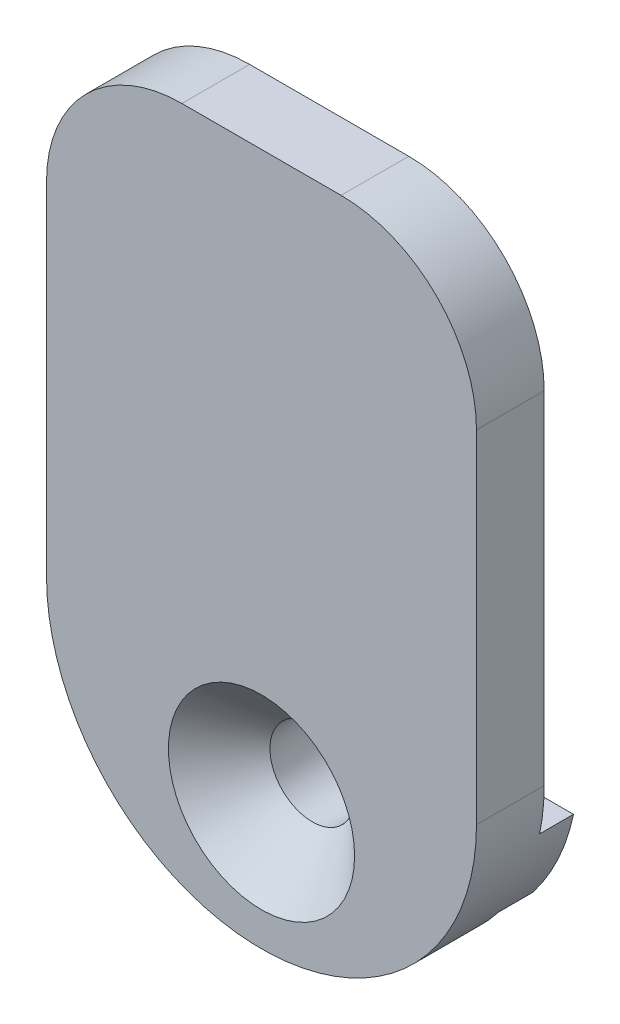
ISO-10303-21;
HEADER;
FILE_DESCRIPTION(('STEP AP214'),'2;1');
FILE_NAME('part.step','',(''),(''),'','','');
FILE_SCHEMA(('AUTOMOTIVE_DESIGN { 1 0 10303 214 1 1 1 1 }'));
ENDSEC;
DATA;
#1=APPLICATION_CONTEXT('core data for automotive mechanical design processes');
#2=APPLICATION_PROTOCOL_DEFINITION('international standard','automotive_design',2000,#1);
#3=PRODUCT_CONTEXT('',#1,'mechanical');
#4=PRODUCT('Part','Part','',(#3));
#5=PRODUCT_RELATED_PRODUCT_CATEGORY('part','',(#4));
#6=PRODUCT_DEFINITION_FORMATION('','',#4);
#7=PRODUCT_DEFINITION_CONTEXT('part definition',#1,'design');
#8=PRODUCT_DEFINITION('design','',#6,#7);
#9=PRODUCT_DEFINITION_SHAPE('','',#8);
#10=(LENGTH_UNIT() NAMED_UNIT(*) SI_UNIT(.MILLI.,.METRE.));
#11=(NAMED_UNIT(*) PLANE_ANGLE_UNIT() SI_UNIT($,.RADIAN.));
#12=(NAMED_UNIT(*) SI_UNIT($,.STERADIAN.) SOLID_ANGLE_UNIT());
#13=UNCERTAINTY_MEASURE_WITH_UNIT(LENGTH_MEASURE(1.E-05),#10,'distance_accuracy_value','');
#14=(GEOMETRIC_REPRESENTATION_CONTEXT(3) GLOBAL_UNCERTAINTY_ASSIGNED_CONTEXT((#13)) GLOBAL_UNIT_ASSIGNED_CONTEXT((#10,
#11,#12)) REPRESENTATION_CONTEXT('',''));
#15=CARTESIAN_POINT('',(0.,0.,0.));
#16=DIRECTION('',(0.,0.,1.));
#17=DIRECTION('',(1.,0.,0.));
#18=AXIS2_PLACEMENT_3D('',#15,#16,#17);
#19=CARTESIAN_POINT('',(0.,5.2,-4.));
#20=DIRECTION('',(0.,0.,-1.));
#21=DIRECTION('',(-1.,0.,0.));
#22=AXIS2_PLACEMENT_3D('',#19,#20,#21);
#23=PLANE('',#22);
#24=CARTESIAN_POINT('',(0.,5.2,-4.));
#25=DIRECTION('',(0.,0.,1.));
#26=DIRECTION('',(1.,0.,0.));
#27=AXIS2_PLACEMENT_3D('',#24,#25,#26);
#28=CIRCLE('',#27,12.7);
#29=CARTESIAN_POINT('',(-10.0224747442934,-2.59999999999999,-4.));
#30=VERTEX_POINT('',#29);
#31=CARTESIAN_POINT('',(10.0224747442934,-2.6,-4.));
#32=VERTEX_POINT('',#31);
#33=EDGE_CURVE('E141',#30,#32,#28,.T.);
#34=ORIENTED_EDGE('',*,*,#33,.F.);
#35=DIRECTION('',(-1.,0.,0.));
#36=VECTOR('',#35,1.);
#37=CARTESIAN_POINT('',(-12.7,-2.6,-4.));
#38=LINE('',#37,#36);
#39=EDGE_CURVE('E135',#30,#32,#38,.F.);
#40=ORIENTED_EDGE('',*,*,#39,.T.);
#41=EDGE_LOOP('',(#34,#40));
#42=FACE_BOUND('',#41,.T.);
#43=ADVANCED_FACE('F17',(#42),#23,.T.);
#44=CARTESIAN_POINT('',(-12.7,-2.6,-6.));
#45=DIRECTION('',(0.,1.,0.));
#46=DIRECTION('',(-1.,0.,0.));
#47=AXIS2_PLACEMENT_3D('',#44,#45,#46);
#48=PLANE('',#47);
#49=DIRECTION('',(-1.,0.,0.));
#50=VECTOR('',#49,1.);
#51=CARTESIAN_POINT('',(0.,-2.6,-6.));
#52=LINE('',#51,#50);
#53=CARTESIAN_POINT('',(10.0224747442934,-2.6,-6.));
#54=VERTEX_POINT('',#53);
#55=CARTESIAN_POINT('',(-10.0224747442934,-2.6,-6.));
#56=VERTEX_POINT('',#55);
#57=EDGE_CURVE('E133',#54,#56,#52,.T.);
#58=ORIENTED_EDGE('',*,*,#57,.F.);
#59=DIRECTION('',(0.,0.,1.));
#60=VECTOR('',#59,1.);
#61=CARTESIAN_POINT('',(10.0224747442934,-2.6,-4.));
#62=LINE('',#61,#60);
#63=EDGE_CURVE('E147',#32,#54,#62,.F.);
#64=ORIENTED_EDGE('',*,*,#63,.F.);
#65=ORIENTED_EDGE('',*,*,#39,.F.);
#66=DIRECTION('',(0.,0.,1.));
#67=VECTOR('',#66,1.);
#68=CARTESIAN_POINT('',(-10.0224747442934,-2.59999999999999,-4.));
#69=LINE('',#68,#67);
#70=EDGE_CURVE('E139',#56,#30,#69,.T.);
#71=ORIENTED_EDGE('',*,*,#70,.F.);
#72=EDGE_LOOP('',(#58,#64,#65,#71));
#73=FACE_BOUND('',#72,.T.);
#74=ADVANCED_FACE('F177',(#73),#48,.F.);
#75=CARTESIAN_POINT('',(-12.7,2.6,-6.));
#76=DIRECTION('',(0.,-1.,0.));
#77=DIRECTION('',(0.,0.,-1.));
#78=AXIS2_PLACEMENT_3D('',#75,#76,#77);
#79=PLANE('',#78);
#80=DIRECTION('',(-1.,0.,0.));
#81=VECTOR('',#80,1.);
#82=CARTESIAN_POINT('',(0.,2.6,-6.));
#83=LINE('',#82,#81);
#84=CARTESIAN_POINT('',(-12.4310096130604,2.60000000000001,-6.));
#85=VERTEX_POINT('',#84);
#86=CARTESIAN_POINT('',(12.4310096130604,2.6,-6.));
#87=VERTEX_POINT('',#86);
#88=EDGE_CURVE('E130',#85,#87,#83,.F.);
#89=ORIENTED_EDGE('',*,*,#88,.F.);
#90=DIRECTION('',(0.,0.,1.));
#91=VECTOR('',#90,1.);
#92=CARTESIAN_POINT('',(-12.4310096130604,2.60000000000001,-4.));
#93=LINE('',#92,#91);
#94=CARTESIAN_POINT('',(-12.4310096130604,2.60000000000001,-4.));
#95=VERTEX_POINT('',#94);
#96=EDGE_CURVE('E136',#95,#85,#93,.F.);
#97=ORIENTED_EDGE('',*,*,#96,.F.);
#98=DIRECTION('',(-1.,0.,0.));
#99=VECTOR('',#98,1.);
#100=CARTESIAN_POINT('',(0.,2.6,-4.));
#101=LINE('',#100,#99);
#102=CARTESIAN_POINT('',(12.4310096130604,2.6,-4.));
#103=VERTEX_POINT('',#102);
#104=EDGE_CURVE('E129',#103,#95,#101,.T.);
#105=ORIENTED_EDGE('',*,*,#104,.F.);
#106=DIRECTION('',(0.,0.,1.));
#107=VECTOR('',#106,1.);
#108=CARTESIAN_POINT('',(12.4310096130604,2.6,-4.));
#109=LINE('',#108,#107);
#110=EDGE_CURVE('E143',#87,#103,#109,.T.);
#111=ORIENTED_EDGE('',*,*,#110,.F.);
#112=EDGE_LOOP('',(#89,#97,#105,#111));
#113=FACE_BOUND('',#112,.T.);
#114=ADVANCED_FACE('F186',(#113),#79,.F.);
#115=CARTESIAN_POINT('',(0.,5.2,-6.));
#116=DIRECTION('',(0.,0.,-1.));
#117=DIRECTION('',(-1.,0.,0.));
#118=AXIS2_PLACEMENT_3D('',#115,#116,#117);
#119=PLANE('',#118);
#120=CARTESIAN_POINT('',(0.,0.,-6.));
#121=DIRECTION('',(0.,0.,1.));
#122=DIRECTION('',(1.,0.,0.));
#123=AXIS2_PLACEMENT_3D('',#120,#121,#122);
#124=CIRCLE('',#123,2.5);
#125=CARTESIAN_POINT('',(2.5,0.,-6.));
#126=VERTEX_POINT('',#125);
#127=EDGE_CURVE('E20',#126,#126,#124,.T.);
#128=ORIENTED_EDGE('',*,*,#127,.T.);
#129=EDGE_LOOP('',(#128));
#130=FACE_BOUND('',#129,.T.);
#131=ORIENTED_EDGE('',*,*,#88,.T.);
#132=CARTESIAN_POINT('',(0.,5.2,-6.));
#133=DIRECTION('',(0.,0.,1.));
#134=DIRECTION('',(1.,0.,0.));
#135=AXIS2_PLACEMENT_3D('',#132,#133,#134);
#136=CIRCLE('',#135,12.7);
#137=EDGE_CURVE('E146',#54,#87,#136,.T.);
#138=ORIENTED_EDGE('',*,*,#137,.F.);
#139=ORIENTED_EDGE('',*,*,#57,.T.);
#140=CARTESIAN_POINT('',(0.,5.2,-6.));
#141=DIRECTION('',(0.,0.,1.));
#142=DIRECTION('',(1.,0.,0.));
#143=AXIS2_PLACEMENT_3D('',#140,#141,#142);
#144=CIRCLE('',#143,12.7);
#145=EDGE_CURVE('E128',#85,#56,#144,.T.);
#146=ORIENTED_EDGE('',*,*,#145,.F.);
#147=EDGE_LOOP('',(#131,#138,#139,#146));
#148=FACE_BOUND('',#147,.T.);
#149=ADVANCED_FACE('F181',(#130,#148),#119,.T.);
#150=CARTESIAN_POINT('',(0.,5.2,-4.));
#151=DIRECTION('',(0.,0.,-1.));
#152=DIRECTION('',(-1.,0.,0.));
#153=AXIS2_PLACEMENT_3D('',#150,#151,#152);
#154=PLANE('',#153);
#155=CARTESIAN_POINT('',(4.7,25.4,-4.));
#156=DIRECTION('',(0.,0.,1.));
#157=DIRECTION('',(1.,0.,0.));
#158=AXIS2_PLACEMENT_3D('',#155,#156,#157);
#159=CIRCLE('',#158,8.);
#160=CARTESIAN_POINT('',(12.7,25.4,-4.));
#161=VERTEX_POINT('',#160);
#162=CARTESIAN_POINT('',(4.7,33.4,-4.));
#163=VERTEX_POINT('',#162);
#164=EDGE_CURVE('E96',#161,#163,#159,.T.);
#165=ORIENTED_EDGE('',*,*,#164,.F.);
#166=DIRECTION('',(0.,1.,0.));
#167=VECTOR('',#166,1.);
#168=CARTESIAN_POINT('',(12.7,33.4,-4.));
#169=LINE('',#168,#167);
#170=CARTESIAN_POINT('',(12.7,5.2,-4.));
#171=VERTEX_POINT('',#170);
#172=EDGE_CURVE('E91',#171,#161,#169,.T.);
#173=ORIENTED_EDGE('',*,*,#172,.F.);
#174=CARTESIAN_POINT('',(0.,5.2,-4.));
#175=DIRECTION('',(0.,0.,1.));
#176=DIRECTION('',(1.,0.,0.));
#177=AXIS2_PLACEMENT_3D('',#174,#175,#176);
#178=CIRCLE('',#177,12.7);
#179=EDGE_CURVE('E145',#103,#171,#178,.T.);
#180=ORIENTED_EDGE('',*,*,#179,.F.);
#181=ORIENTED_EDGE('',*,*,#104,.T.);
#182=CARTESIAN_POINT('',(0.,5.2,-4.));
#183=DIRECTION('',(0.,0.,1.));
#184=DIRECTION('',(1.,0.,0.));
#185=AXIS2_PLACEMENT_3D('',#182,#183,#184);
#186=CIRCLE('',#185,12.7);
#187=CARTESIAN_POINT('',(-12.7,5.2,-4.));
#188=VERTEX_POINT('',#187);
#189=EDGE_CURVE('E138',#188,#95,#186,.T.);
#190=ORIENTED_EDGE('',*,*,#189,.F.);
#191=DIRECTION('',(0.,-1.,0.));
#192=VECTOR('',#191,1.);
#193=CARTESIAN_POINT('',(-12.7,33.4,-4.));
#194=LINE('',#193,#192);
#195=CARTESIAN_POINT('',(-12.7,25.4,-4.));
#196=VERTEX_POINT('',#195);
#197=EDGE_CURVE('E125',#196,#188,#194,.T.);
#198=ORIENTED_EDGE('',*,*,#197,.F.);
#199=CARTESIAN_POINT('',(-4.7,25.4,-4.));
#200=DIRECTION('',(0.,0.,1.));
#201=DIRECTION('',(1.,0.,0.));
#202=AXIS2_PLACEMENT_3D('',#199,#200,#201);
#203=CIRCLE('',#202,8.);
#204=CARTESIAN_POINT('',(-4.7,33.4,-4.));
#205=VERTEX_POINT('',#204);
#206=EDGE_CURVE('E109',#205,#196,#203,.T.);
#207=ORIENTED_EDGE('',*,*,#206,.F.);
#208=DIRECTION('',(1.,0.,0.));
#209=VECTOR('',#208,1.);
#210=CARTESIAN_POINT('',(-12.7,33.4,-4.));
#211=LINE('',#210,#209);
#212=EDGE_CURVE('E105',#163,#205,#211,.F.);
#213=ORIENTED_EDGE('',*,*,#212,.F.);
#214=EDGE_LOOP('',(#165,#173,#180,#181,#190,#198,#207,#213));
#215=FACE_BOUND('',#214,.T.);
#216=ADVANCED_FACE('F107',(#215),#154,.T.);
#217=CARTESIAN_POINT('',(0.,0.,-4.));
#218=DIRECTION('',(0.,0.,1.));
#219=DIRECTION('',(1.,0.,0.));
#220=AXIS2_PLACEMENT_3D('',#217,#218,#219);
#221=CYLINDRICAL_SURFACE('',#220,2.5);
#222=ORIENTED_EDGE('',*,*,#127,.F.);
#223=EDGE_LOOP('',(#222));
#224=FACE_BOUND('',#223,.T.);
#225=CARTESIAN_POINT('',(0.,0.,-2.9999999999859));
#226=DIRECTION('',(0.,0.,1.));
#227=DIRECTION('',(1.,0.,0.));
#228=AXIS2_PLACEMENT_3D('',#225,#226,#227);
#229=CIRCLE('',#228,2.49999999999773);
#230=CARTESIAN_POINT('',(2.49999999999773,0.,-2.9999999999859));
#231=VERTEX_POINT('',#230);
#232=EDGE_CURVE('E122',#231,#231,#229,.T.);
#233=ORIENTED_EDGE('',*,*,#232,.T.);
#234=EDGE_LOOP('',(#233));
#235=FACE_BOUND('',#234,.T.);
#236=ADVANCED_FACE('F232',(#224,#235),#221,.F.);
#237=CARTESIAN_POINT('',(-12.7,33.4,-4.));
#238=DIRECTION('',(0.,1.,0.));
#239=DIRECTION('',(0.,0.,1.));
#240=AXIS2_PLACEMENT_3D('',#237,#238,#239);
#241=PLANE('',#240);
#242=ORIENTED_EDGE('',*,*,#212,.T.);
#243=DIRECTION('',(0.,0.,1.));
#244=VECTOR('',#243,1.);
#245=CARTESIAN_POINT('',(-4.7,33.4,-4.));
#246=LINE('',#245,#244);
#247=CARTESIAN_POINT('',(-4.7,33.4,0.));
#248=VERTEX_POINT('',#247);
#249=EDGE_CURVE('E160',#248,#205,#246,.F.);
#250=ORIENTED_EDGE('',*,*,#249,.F.);
#251=DIRECTION('',(-1.,0.,0.));
#252=VECTOR('',#251,1.);
#253=CARTESIAN_POINT('',(0.,33.4,0.));
#254=LINE('',#253,#252);
#255=CARTESIAN_POINT('',(4.7,33.4,0.));
#256=VERTEX_POINT('',#255);
#257=EDGE_CURVE('E116',#248,#256,#254,.F.);
#258=ORIENTED_EDGE('',*,*,#257,.T.);
#259=DIRECTION('',(0.,0.,1.));
#260=VECTOR('',#259,1.);
#261=CARTESIAN_POINT('',(4.7,33.4,-4.));
#262=LINE('',#261,#260);
#263=EDGE_CURVE('E101',#163,#256,#262,.T.);
#264=ORIENTED_EDGE('',*,*,#263,.F.);
#265=EDGE_LOOP('',(#242,#250,#258,#264));
#266=FACE_BOUND('',#265,.T.);
#267=ADVANCED_FACE('F115',(#266),#241,.T.);
#268=CARTESIAN_POINT('',(4.7,25.4,-4.));
#269=DIRECTION('',(0.,0.,1.));
#270=DIRECTION('',(1.,0.,0.));
#271=AXIS2_PLACEMENT_3D('',#268,#269,#270);
#272=CYLINDRICAL_SURFACE('',#271,8.);
#273=ORIENTED_EDGE('',*,*,#164,.T.);
#274=ORIENTED_EDGE('',*,*,#263,.T.);
#275=CARTESIAN_POINT('',(4.7,25.4,0.));
#276=DIRECTION('',(0.,0.,1.));
#277=DIRECTION('',(1.,0.,0.));
#278=AXIS2_PLACEMENT_3D('',#275,#276,#277);
#279=CIRCLE('',#278,8.);
#280=CARTESIAN_POINT('',(12.7,25.4,0.));
#281=VERTEX_POINT('',#280);
#282=EDGE_CURVE('E157',#256,#281,#279,.F.);
#283=ORIENTED_EDGE('',*,*,#282,.T.);
#284=DIRECTION('',(0.,0.,1.));
#285=VECTOR('',#284,1.);
#286=CARTESIAN_POINT('',(12.7,25.4,-4.));
#287=LINE('',#286,#285);
#288=EDGE_CURVE('E103',#161,#281,#287,.T.);
#289=ORIENTED_EDGE('',*,*,#288,.F.);
#290=EDGE_LOOP('',(#273,#274,#283,#289));
#291=FACE_BOUND('',#290,.T.);
#292=ADVANCED_FACE('F98',(#291),#272,.T.);
#293=CARTESIAN_POINT('',(12.7,33.4,-4.));
#294=DIRECTION('',(1.,0.,0.));
#295=DIRECTION('',(0.,1.,0.));
#296=AXIS2_PLACEMENT_3D('',#293,#294,#295);
#297=PLANE('',#296);
#298=ORIENTED_EDGE('',*,*,#172,.T.);
#299=ORIENTED_EDGE('',*,*,#288,.T.);
#300=DIRECTION('',(0.,1.,0.));
#301=VECTOR('',#300,1.);
#302=CARTESIAN_POINT('',(12.7,5.2,0.));
#303=LINE('',#302,#301);
#304=CARTESIAN_POINT('',(12.7,5.2,0.));
#305=VERTEX_POINT('',#304);
#306=EDGE_CURVE('E156',#281,#305,#303,.F.);
#307=ORIENTED_EDGE('',*,*,#306,.T.);
#308=DIRECTION('',(0.,0.,1.));
#309=VECTOR('',#308,1.);
#310=CARTESIAN_POINT('',(12.7,5.2,-4.));
#311=LINE('',#310,#309);
#312=EDGE_CURVE('E165',#171,#305,#311,.T.);
#313=ORIENTED_EDGE('',*,*,#312,.F.);
#314=EDGE_LOOP('',(#298,#299,#307,#313));
#315=FACE_BOUND('',#314,.T.);
#316=ADVANCED_FACE('F198',(#315),#297,.T.);
#317=CARTESIAN_POINT('',(0.,5.2,-4.));
#318=DIRECTION('',(0.,0.,1.));
#319=DIRECTION('',(1.,0.,0.));
#320=AXIS2_PLACEMENT_3D('',#317,#318,#319);
#321=CYLINDRICAL_SURFACE('',#320,12.7);
#322=ORIENTED_EDGE('',*,*,#96,.T.);
#323=ORIENTED_EDGE('',*,*,#145,.T.);
#324=ORIENTED_EDGE('',*,*,#70,.T.);
#325=ORIENTED_EDGE('',*,*,#33,.T.);
#326=ORIENTED_EDGE('',*,*,#63,.T.);
#327=ORIENTED_EDGE('',*,*,#137,.T.);
#328=ORIENTED_EDGE('',*,*,#110,.T.);
#329=ORIENTED_EDGE('',*,*,#179,.T.);
#330=ORIENTED_EDGE('',*,*,#312,.T.);
#331=CARTESIAN_POINT('',(0.,5.2,0.));
#332=DIRECTION('',(0.,0.,1.));
#333=DIRECTION('',(1.,0.,0.));
#334=AXIS2_PLACEMENT_3D('',#331,#332,#333);
#335=CIRCLE('',#334,12.7);
#336=CARTESIAN_POINT('',(-12.7,5.2,0.));
#337=VERTEX_POINT('',#336);
#338=EDGE_CURVE('E153',#305,#337,#335,.F.);
#339=ORIENTED_EDGE('',*,*,#338,.T.);
#340=DIRECTION('',(0.,0.,1.));
#341=VECTOR('',#340,1.);
#342=CARTESIAN_POINT('',(-12.7,5.2,-4.));
#343=LINE('',#342,#341);
#344=EDGE_CURVE('E127',#188,#337,#343,.T.);
#345=ORIENTED_EDGE('',*,*,#344,.F.);
#346=ORIENTED_EDGE('',*,*,#189,.T.);
#347=EDGE_LOOP('',(#322,#323,#324,#325,#326,#327,#328,#329,#330,#339,#345,#346));
#348=FACE_BOUND('',#347,.T.);
#349=ADVANCED_FACE('F171',(#348),#321,.T.);
#350=CARTESIAN_POINT('',(-12.7,33.4,-4.));
#351=DIRECTION('',(-1.,0.,0.));
#352=DIRECTION('',(0.,-1.,0.));
#353=AXIS2_PLACEMENT_3D('',#350,#351,#352);
#354=PLANE('',#353);
#355=DIRECTION('',(0.,1.,0.));
#356=VECTOR('',#355,1.);
#357=CARTESIAN_POINT('',(-12.7,5.2,0.));
#358=LINE('',#357,#356);
#359=CARTESIAN_POINT('',(-12.7,25.4,0.));
#360=VERTEX_POINT('',#359);
#361=EDGE_CURVE('E152',#337,#360,#358,.T.);
#362=ORIENTED_EDGE('',*,*,#361,.T.);
#363=DIRECTION('',(0.,0.,1.));
#364=VECTOR('',#363,1.);
#365=CARTESIAN_POINT('',(-12.7,25.4,-4.));
#366=LINE('',#365,#364);
#367=EDGE_CURVE('E35',#196,#360,#366,.T.);
#368=ORIENTED_EDGE('',*,*,#367,.F.);
#369=ORIENTED_EDGE('',*,*,#197,.T.);
#370=ORIENTED_EDGE('',*,*,#344,.T.);
#371=EDGE_LOOP('',(#362,#368,#369,#370));
#372=FACE_BOUND('',#371,.T.);
#373=ADVANCED_FACE('F206',(#372),#354,.T.);
#374=CARTESIAN_POINT('',(-4.7,25.4,-4.));
#375=DIRECTION('',(0.,0.,1.));
#376=DIRECTION('',(1.,0.,0.));
#377=AXIS2_PLACEMENT_3D('',#374,#375,#376);
#378=CYLINDRICAL_SURFACE('',#377,8.);
#379=ORIENTED_EDGE('',*,*,#206,.T.);
#380=ORIENTED_EDGE('',*,*,#367,.T.);
#381=CARTESIAN_POINT('',(-4.7,25.4,0.));
#382=DIRECTION('',(0.,0.,1.));
#383=DIRECTION('',(1.,0.,0.));
#384=AXIS2_PLACEMENT_3D('',#381,#382,#383);
#385=CIRCLE('',#384,8.);
#386=EDGE_CURVE('E26',#360,#248,#385,.F.);
#387=ORIENTED_EDGE('',*,*,#386,.T.);
#388=ORIENTED_EDGE('',*,*,#249,.T.);
#389=EDGE_LOOP('',(#379,#380,#387,#388));
#390=FACE_BOUND('',#389,.T.);
#391=ADVANCED_FACE('F208',(#390),#378,.T.);
#392=CARTESIAN_POINT('',(0.,0.,-5.6843418860808E-11));
#393=DIRECTION('',(0.,0.,1.));
#394=DIRECTION('',(1.,0.,0.));
#395=AXIS2_PLACEMENT_3D('',#392,#393,#394);
#396=CONICAL_SURFACE('',#395,5.49999999992679,0.785398163397448);
#397=ORIENTED_EDGE('',*,*,#232,.F.);
#398=EDGE_LOOP('',(#397));
#399=FACE_BOUND('',#398,.T.);
#400=CARTESIAN_POINT('',(0.,0.,-5.6843418860808E-11));
#401=DIRECTION('',(0.,0.,1.));
#402=DIRECTION('',(1.,0.,0.));
#403=AXIS2_PLACEMENT_3D('',#400,#401,#402);
#404=CIRCLE('',#403,5.49999999992679);
#405=CARTESIAN_POINT('',(5.49999999992679,0.,-5.6843418860808E-11));
#406=VERTEX_POINT('',#405);
#407=EDGE_CURVE('E11',#406,#406,#404,.T.);
#408=ORIENTED_EDGE('',*,*,#407,.T.);
#409=EDGE_LOOP('',(#408));
#410=FACE_BOUND('',#409,.T.);
#411=ADVANCED_FACE('F215',(#399,#410),#396,.F.);
#412=CARTESIAN_POINT('',(0.,5.2,0.));
#413=DIRECTION('',(0.,0.,-1.));
#414=DIRECTION('',(-1.,0.,0.));
#415=AXIS2_PLACEMENT_3D('',#412,#413,#414);
#416=PLANE('',#415);
#417=ORIENTED_EDGE('',*,*,#407,.F.);
#418=EDGE_LOOP('',(#417));
#419=FACE_BOUND('',#418,.T.);
#420=ORIENTED_EDGE('',*,*,#361,.F.);
#421=ORIENTED_EDGE('',*,*,#338,.F.);
#422=ORIENTED_EDGE('',*,*,#306,.F.);
#423=ORIENTED_EDGE('',*,*,#282,.F.);
#424=ORIENTED_EDGE('',*,*,#257,.F.);
#425=ORIENTED_EDGE('',*,*,#386,.F.);
#426=EDGE_LOOP('',(#420,#421,#422,#423,#424,#425));
#427=FACE_BOUND('',#426,.T.);
#428=ADVANCED_FACE('F196',(#419,#427),#416,.F.);
#429=CLOSED_SHELL('',(#43,#74,#114,#149,#216,#236,#267,#292,#316,#349,#373,#391,#411,#428));
#430=MANIFOLD_SOLID_BREP('B1',#429);
#431=ADVANCED_BREP_SHAPE_REPRESENTATION('',(#18,#430),#14);
#432=SHAPE_DEFINITION_REPRESENTATION(#9,#431);
ENDSEC;
END-ISO-10303-21;
